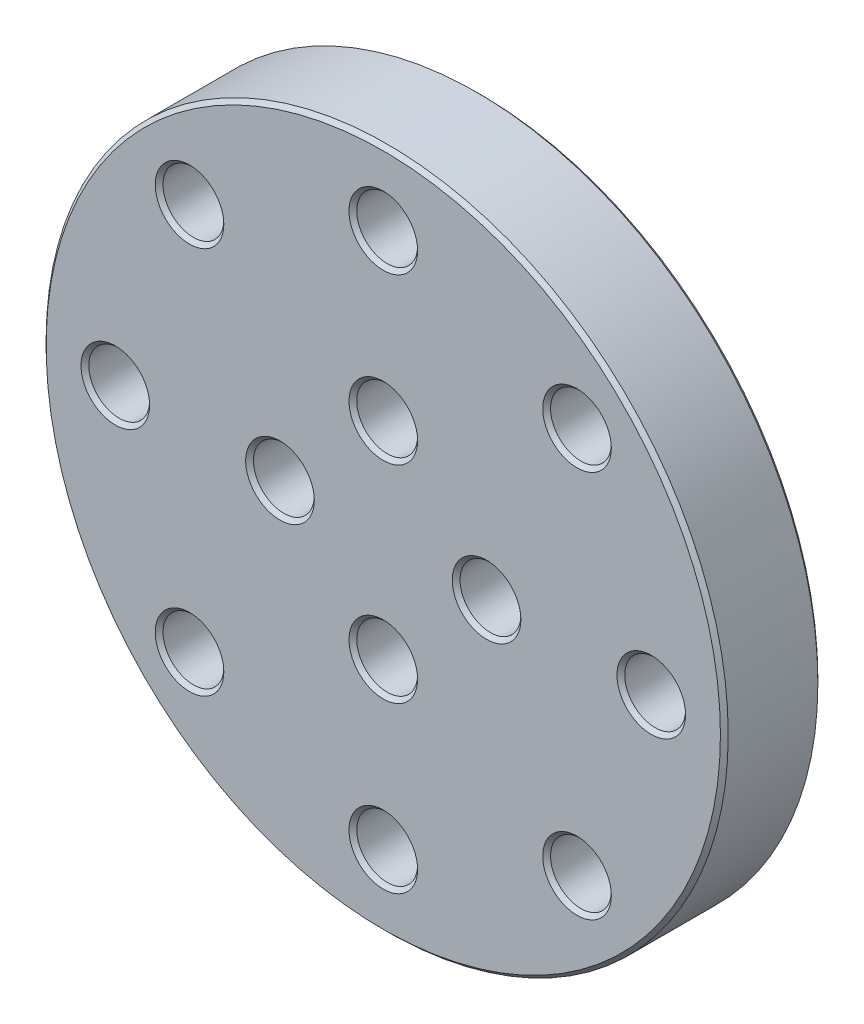
ISO-10303-21;
HEADER;
FILE_DESCRIPTION(('STEP AP214'),'2;1');
FILE_NAME('part.step','',(''),(''),'','','');
FILE_SCHEMA(('AUTOMOTIVE_DESIGN { 1 0 10303 214 1 1 1 1 }'));
ENDSEC;
DATA;
#1=APPLICATION_CONTEXT('core data for automotive mechanical design processes');
#2=APPLICATION_PROTOCOL_DEFINITION('international standard','automotive_design',2000,#1);
#3=PRODUCT_CONTEXT('',#1,'mechanical');
#4=PRODUCT('Part','Part','',(#3));
#5=PRODUCT_RELATED_PRODUCT_CATEGORY('part','',(#4));
#6=PRODUCT_DEFINITION_FORMATION('','',#4);
#7=PRODUCT_DEFINITION_CONTEXT('part definition',#1,'design');
#8=PRODUCT_DEFINITION('design','',#6,#7);
#9=PRODUCT_DEFINITION_SHAPE('','',#8);
#10=(LENGTH_UNIT() NAMED_UNIT(*) SI_UNIT(.MILLI.,.METRE.));
#11=(NAMED_UNIT(*) PLANE_ANGLE_UNIT() SI_UNIT($,.RADIAN.));
#12=(NAMED_UNIT(*) SI_UNIT($,.STERADIAN.) SOLID_ANGLE_UNIT());
#13=UNCERTAINTY_MEASURE_WITH_UNIT(LENGTH_MEASURE(1.E-05),#10,'distance_accuracy_value','');
#14=(GEOMETRIC_REPRESENTATION_CONTEXT(3) GLOBAL_UNCERTAINTY_ASSIGNED_CONTEXT((#13)) GLOBAL_UNIT_ASSIGNED_CONTEXT((#10,
#11,#12)) REPRESENTATION_CONTEXT('',''));
#15=CARTESIAN_POINT('',(0.,0.,0.));
#16=DIRECTION('',(0.,0.,1.));
#17=DIRECTION('',(1.,0.,0.));
#18=AXIS2_PLACEMENT_3D('',#15,#16,#17);
#19=CARTESIAN_POINT('',(0.,0.,12.7));
#20=DIRECTION('',(0.,0.,1.));
#21=DIRECTION('',(1.,0.,0.));
#22=AXIS2_PLACEMENT_3D('',#19,#20,#21);
#23=PLANE('',#22);
#24=CARTESIAN_POINT('',(0.,0.,12.7));
#25=DIRECTION('',(0.,0.,1.));
#26=DIRECTION('',(1.,0.,0.));
#27=AXIS2_PLACEMENT_3D('',#24,#25,#26);
#28=CIRCLE('',#27,43.942);
#29=CARTESIAN_POINT('',(43.942,0.,12.7));
#30=VERTEX_POINT('',#29);
#31=EDGE_CURVE('E47',#30,#30,#28,.T.);
#32=ORIENTED_EDGE('',*,*,#31,.T.);
#33=EDGE_LOOP('',(#32));
#34=FACE_BOUND('',#33,.T.);
#35=CARTESIAN_POINT('',(25.2524802124464,25.2524802124465,12.7));
#36=DIRECTION('',(0.,0.,1.));
#37=DIRECTION('',(1.,0.,0.));
#38=AXIS2_PLACEMENT_3D('',#35,#36,#37);
#39=CIRCLE('',#38,4.47040000000001);
#40=CARTESIAN_POINT('',(29.7228802124464,25.2524802124465,12.7));
#41=VERTEX_POINT('',#40);
#42=EDGE_CURVE('E52',#41,#41,#39,.F.);
#43=ORIENTED_EDGE('',*,*,#42,.T.);
#44=EDGE_LOOP('',(#43));
#45=FACE_BOUND('',#44,.T.);
#46=CARTESIAN_POINT('',(25.2524802124464,-25.2524802124465,12.7));
#47=DIRECTION('',(0.,0.,1.));
#48=DIRECTION('',(1.,0.,0.));
#49=AXIS2_PLACEMENT_3D('',#46,#47,#48);
#50=CIRCLE('',#49,4.47040000000001);
#51=CARTESIAN_POINT('',(29.7228802124464,-25.2524802124465,12.7));
#52=VERTEX_POINT('',#51);
#53=EDGE_CURVE('E55',#52,#52,#50,.F.);
#54=ORIENTED_EDGE('',*,*,#53,.T.);
#55=EDGE_LOOP('',(#54));
#56=FACE_BOUND('',#55,.T.);
#57=CARTESIAN_POINT('',(-25.2524802124466,-25.2524802124463,12.7));
#58=DIRECTION('',(0.,0.,1.));
#59=DIRECTION('',(1.,0.,0.));
#60=AXIS2_PLACEMENT_3D('',#57,#58,#59);
#61=CIRCLE('',#60,4.47040000000001);
#62=CARTESIAN_POINT('',(-20.7820802124466,-25.2524802124463,12.7));
#63=VERTEX_POINT('',#62);
#64=EDGE_CURVE('E58',#63,#63,#61,.F.);
#65=ORIENTED_EDGE('',*,*,#64,.T.);
#66=EDGE_LOOP('',(#65));
#67=FACE_BOUND('',#66,.T.);
#68=CARTESIAN_POINT('',(-25.2524802124466,25.2524802124463,12.7));
#69=DIRECTION('',(0.,0.,1.));
#70=DIRECTION('',(1.,0.,0.));
#71=AXIS2_PLACEMENT_3D('',#68,#69,#70);
#72=CIRCLE('',#71,4.47040000000001);
#73=CARTESIAN_POINT('',(-20.7820802124466,25.2524802124463,12.7));
#74=VERTEX_POINT('',#73);
#75=EDGE_CURVE('E61',#74,#74,#72,.F.);
#76=ORIENTED_EDGE('',*,*,#75,.T.);
#77=EDGE_LOOP('',(#76));
#78=FACE_BOUND('',#77,.T.);
#79=CARTESIAN_POINT('',(13.462,0.,12.7));
#80=DIRECTION('',(0.,0.,1.));
#81=DIRECTION('',(1.,0.,0.));
#82=AXIS2_PLACEMENT_3D('',#79,#80,#81);
#83=CIRCLE('',#82,4.4704);
#84=CARTESIAN_POINT('',(17.9324,0.,12.7));
#85=VERTEX_POINT('',#84);
#86=EDGE_CURVE('E124',#85,#85,#83,.F.);
#87=ORIENTED_EDGE('',*,*,#86,.T.);
#88=EDGE_LOOP('',(#87));
#89=FACE_BOUND('',#88,.T.);
#90=CARTESIAN_POINT('',(0.,-13.462,12.7));
#91=DIRECTION('',(0.,0.,1.));
#92=DIRECTION('',(1.,0.,0.));
#93=AXIS2_PLACEMENT_3D('',#90,#91,#92);
#94=CIRCLE('',#93,4.4704);
#95=CARTESIAN_POINT('',(4.4704,-13.462,12.7));
#96=VERTEX_POINT('',#95);
#97=EDGE_CURVE('E127',#96,#96,#94,.F.);
#98=ORIENTED_EDGE('',*,*,#97,.T.);
#99=EDGE_LOOP('',(#98));
#100=FACE_BOUND('',#99,.T.);
#101=CARTESIAN_POINT('',(-13.462,0.,12.7));
#102=DIRECTION('',(0.,0.,1.));
#103=DIRECTION('',(1.,0.,0.));
#104=AXIS2_PLACEMENT_3D('',#101,#102,#103);
#105=CIRCLE('',#104,4.4704);
#106=CARTESIAN_POINT('',(-8.99159999999999,0.,12.7));
#107=VERTEX_POINT('',#106);
#108=EDGE_CURVE('E130',#107,#107,#105,.F.);
#109=ORIENTED_EDGE('',*,*,#108,.T.);
#110=EDGE_LOOP('',(#109));
#111=FACE_BOUND('',#110,.T.);
#112=CARTESIAN_POINT('',(0.,13.462,12.7));
#113=DIRECTION('',(0.,0.,1.));
#114=DIRECTION('',(1.,0.,0.));
#115=AXIS2_PLACEMENT_3D('',#112,#113,#114);
#116=CIRCLE('',#115,4.4704);
#117=CARTESIAN_POINT('',(4.4704,13.462,12.7));
#118=VERTEX_POINT('',#117);
#119=EDGE_CURVE('E133',#118,#118,#116,.F.);
#120=ORIENTED_EDGE('',*,*,#119,.T.);
#121=EDGE_LOOP('',(#120));
#122=FACE_BOUND('',#121,.T.);
#123=CARTESIAN_POINT('',(-34.925,-3.75722139002858E-13,12.7));
#124=DIRECTION('',(0.,0.,1.));
#125=DIRECTION('',(1.,0.,0.));
#126=AXIS2_PLACEMENT_3D('',#123,#124,#125);
#127=CIRCLE('',#126,4.4704);
#128=CARTESIAN_POINT('',(-30.4546,-3.75722139002858E-13,12.7));
#129=VERTEX_POINT('',#128);
#130=EDGE_CURVE('E136',#129,#129,#127,.F.);
#131=ORIENTED_EDGE('',*,*,#130,.T.);
#132=EDGE_LOOP('',(#131));
#133=FACE_BOUND('',#132,.T.);
#134=CARTESIAN_POINT('',(-2.53782153243762E-13,34.925,12.7));
#135=DIRECTION('',(0.,0.,1.));
#136=DIRECTION('',(1.,0.,0.));
#137=AXIS2_PLACEMENT_3D('',#134,#135,#136);
#138=CIRCLE('',#137,4.4704);
#139=CARTESIAN_POINT('',(4.47039999999975,34.925,12.7));
#140=VERTEX_POINT('',#139);
#141=EDGE_CURVE('E139',#140,#140,#138,.F.);
#142=ORIENTED_EDGE('',*,*,#141,.T.);
#143=EDGE_LOOP('',(#142));
#144=FACE_BOUND('',#143,.T.);
#145=CARTESIAN_POINT('',(34.925,1.31842167484666E-13,12.7));
#146=DIRECTION('',(0.,0.,1.));
#147=DIRECTION('',(1.,0.,0.));
#148=AXIS2_PLACEMENT_3D('',#145,#146,#147);
#149=CIRCLE('',#148,4.4704);
#150=CARTESIAN_POINT('',(39.3954,1.31842167484666E-13,12.7));
#151=VERTEX_POINT('',#150);
#152=EDGE_CURVE('E142',#151,#151,#149,.F.);
#153=ORIENTED_EDGE('',*,*,#152,.T.);
#154=EDGE_LOOP('',(#153));
#155=FACE_BOUND('',#154,.T.);
#156=CARTESIAN_POINT('',(0.,-34.925,12.7));
#157=DIRECTION('',(0.,0.,1.));
#158=DIRECTION('',(1.,0.,0.));
#159=AXIS2_PLACEMENT_3D('',#156,#157,#158);
#160=CIRCLE('',#159,4.4704);
#161=CARTESIAN_POINT('',(4.47040000000001,-34.925,12.7));
#162=VERTEX_POINT('',#161);
#163=EDGE_CURVE('E145',#162,#162,#160,.F.);
#164=ORIENTED_EDGE('',*,*,#163,.T.);
#165=EDGE_LOOP('',(#164));
#166=FACE_BOUND('',#165,.T.);
#167=ADVANCED_FACE('F32',(#34,#45,#56,#67,#78,#89,#100,#111,#122,#133,#144,#155,#166),#23,.T.);
#168=CARTESIAN_POINT('',(0.,0.,0.));
#169=DIRECTION('',(0.,0.,1.));
#170=DIRECTION('',(1.,0.,0.));
#171=AXIS2_PLACEMENT_3D('',#168,#169,#170);
#172=PLANE('',#171);
#173=CARTESIAN_POINT('',(0.,0.,0.));
#174=DIRECTION('',(0.,0.,1.));
#175=DIRECTION('',(1.,0.,0.));
#176=AXIS2_PLACEMENT_3D('',#173,#174,#175);
#177=CIRCLE('',#176,43.942);
#178=CARTESIAN_POINT('',(43.942,0.,0.));
#179=VERTEX_POINT('',#178);
#180=EDGE_CURVE('E10',#179,#179,#177,.F.);
#181=ORIENTED_EDGE('',*,*,#180,.T.);
#182=EDGE_LOOP('',(#181));
#183=FACE_BOUND('',#182,.T.);
#184=CARTESIAN_POINT('',(25.2524802124464,25.2524802124465,0.));
#185=DIRECTION('',(0.,0.,1.));
#186=DIRECTION('',(1.,0.,0.));
#187=AXIS2_PLACEMENT_3D('',#184,#185,#186);
#188=CIRCLE('',#187,4.4704);
#189=CARTESIAN_POINT('',(29.7228802124464,25.2524802124465,0.));
#190=VERTEX_POINT('',#189);
#191=EDGE_CURVE('E97',#190,#190,#188,.T.);
#192=ORIENTED_EDGE('',*,*,#191,.T.);
#193=EDGE_LOOP('',(#192));
#194=FACE_BOUND('',#193,.T.);
#195=CARTESIAN_POINT('',(-25.2524802124466,-25.2524802124463,0.));
#196=DIRECTION('',(0.,0.,1.));
#197=DIRECTION('',(1.,0.,0.));
#198=AXIS2_PLACEMENT_3D('',#195,#196,#197);
#199=CIRCLE('',#198,4.4704);
#200=CARTESIAN_POINT('',(-20.7820802124466,-25.2524802124463,0.));
#201=VERTEX_POINT('',#200);
#202=EDGE_CURVE('E100',#201,#201,#199,.T.);
#203=ORIENTED_EDGE('',*,*,#202,.T.);
#204=EDGE_LOOP('',(#203));
#205=FACE_BOUND('',#204,.T.);
#206=CARTESIAN_POINT('',(25.2524802124464,-25.2524802124465,0.));
#207=DIRECTION('',(0.,0.,1.));
#208=DIRECTION('',(1.,0.,0.));
#209=AXIS2_PLACEMENT_3D('',#206,#207,#208);
#210=CIRCLE('',#209,4.4704);
#211=CARTESIAN_POINT('',(29.7228802124464,-25.2524802124465,0.));
#212=VERTEX_POINT('',#211);
#213=EDGE_CURVE('E103',#212,#212,#210,.T.);
#214=ORIENTED_EDGE('',*,*,#213,.T.);
#215=EDGE_LOOP('',(#214));
#216=FACE_BOUND('',#215,.T.);
#217=CARTESIAN_POINT('',(13.462,0.,0.));
#218=DIRECTION('',(0.,0.,1.));
#219=DIRECTION('',(1.,0.,0.));
#220=AXIS2_PLACEMENT_3D('',#217,#218,#219);
#221=CIRCLE('',#220,4.4704);
#222=CARTESIAN_POINT('',(17.9324,0.,0.));
#223=VERTEX_POINT('',#222);
#224=EDGE_CURVE('E106',#223,#223,#221,.T.);
#225=ORIENTED_EDGE('',*,*,#224,.T.);
#226=EDGE_LOOP('',(#225));
#227=FACE_BOUND('',#226,.T.);
#228=CARTESIAN_POINT('',(0.,-13.462,0.));
#229=DIRECTION('',(0.,0.,1.));
#230=DIRECTION('',(1.,0.,0.));
#231=AXIS2_PLACEMENT_3D('',#228,#229,#230);
#232=CIRCLE('',#231,4.4704);
#233=CARTESIAN_POINT('',(4.4704,-13.462,0.));
#234=VERTEX_POINT('',#233);
#235=EDGE_CURVE('E109',#234,#234,#232,.T.);
#236=ORIENTED_EDGE('',*,*,#235,.T.);
#237=EDGE_LOOP('',(#236));
#238=FACE_BOUND('',#237,.T.);
#239=CARTESIAN_POINT('',(-13.462,0.,0.));
#240=DIRECTION('',(0.,0.,1.));
#241=DIRECTION('',(1.,0.,0.));
#242=AXIS2_PLACEMENT_3D('',#239,#240,#241);
#243=CIRCLE('',#242,4.4704);
#244=CARTESIAN_POINT('',(-8.9916,0.,0.));
#245=VERTEX_POINT('',#244);
#246=EDGE_CURVE('E112',#245,#245,#243,.T.);
#247=ORIENTED_EDGE('',*,*,#246,.T.);
#248=EDGE_LOOP('',(#247));
#249=FACE_BOUND('',#248,.T.);
#250=CARTESIAN_POINT('',(-25.2524802124466,25.2524802124463,0.));
#251=DIRECTION('',(0.,0.,1.));
#252=DIRECTION('',(1.,0.,0.));
#253=AXIS2_PLACEMENT_3D('',#250,#251,#252);
#254=CIRCLE('',#253,4.4704);
#255=CARTESIAN_POINT('',(-20.7820802124466,25.2524802124463,0.));
#256=VERTEX_POINT('',#255);
#257=EDGE_CURVE('E115',#256,#256,#254,.T.);
#258=ORIENTED_EDGE('',*,*,#257,.T.);
#259=EDGE_LOOP('',(#258));
#260=FACE_BOUND('',#259,.T.);
#261=CARTESIAN_POINT('',(0.,13.462,0.));
#262=DIRECTION('',(0.,0.,1.));
#263=DIRECTION('',(1.,0.,0.));
#264=AXIS2_PLACEMENT_3D('',#261,#262,#263);
#265=CIRCLE('',#264,4.4704);
#266=CARTESIAN_POINT('',(4.4704,13.462,0.));
#267=VERTEX_POINT('',#266);
#268=EDGE_CURVE('E181',#267,#267,#265,.T.);
#269=ORIENTED_EDGE('',*,*,#268,.T.);
#270=EDGE_LOOP('',(#269));
#271=FACE_BOUND('',#270,.T.);
#272=CARTESIAN_POINT('',(-2.53782153243762E-13,34.925,0.));
#273=DIRECTION('',(0.,0.,1.));
#274=DIRECTION('',(1.,0.,0.));
#275=AXIS2_PLACEMENT_3D('',#272,#273,#274);
#276=CIRCLE('',#275,4.4704);
#277=CARTESIAN_POINT('',(4.47039999999975,34.925,0.));
#278=VERTEX_POINT('',#277);
#279=EDGE_CURVE('E184',#278,#278,#276,.T.);
#280=ORIENTED_EDGE('',*,*,#279,.T.);
#281=EDGE_LOOP('',(#280));
#282=FACE_BOUND('',#281,.T.);
#283=CARTESIAN_POINT('',(34.925,1.31842167484666E-13,0.));
#284=DIRECTION('',(0.,0.,1.));
#285=DIRECTION('',(1.,0.,0.));
#286=AXIS2_PLACEMENT_3D('',#283,#284,#285);
#287=CIRCLE('',#286,4.4704);
#288=CARTESIAN_POINT('',(39.3954,1.31842167484666E-13,0.));
#289=VERTEX_POINT('',#288);
#290=EDGE_CURVE('E187',#289,#289,#287,.T.);
#291=ORIENTED_EDGE('',*,*,#290,.T.);
#292=EDGE_LOOP('',(#291));
#293=FACE_BOUND('',#292,.T.);
#294=CARTESIAN_POINT('',(0.,-34.925,0.));
#295=DIRECTION('',(0.,0.,1.));
#296=DIRECTION('',(1.,0.,0.));
#297=AXIS2_PLACEMENT_3D('',#294,#295,#296);
#298=CIRCLE('',#297,4.4704);
#299=CARTESIAN_POINT('',(4.47040000000001,-34.925,0.));
#300=VERTEX_POINT('',#299);
#301=EDGE_CURVE('E190',#300,#300,#298,.T.);
#302=ORIENTED_EDGE('',*,*,#301,.T.);
#303=EDGE_LOOP('',(#302));
#304=FACE_BOUND('',#303,.T.);
#305=CARTESIAN_POINT('',(-34.925,-3.75722139002858E-13,0.));
#306=DIRECTION('',(0.,0.,1.));
#307=DIRECTION('',(1.,0.,0.));
#308=AXIS2_PLACEMENT_3D('',#305,#306,#307);
#309=CIRCLE('',#308,4.4704);
#310=CARTESIAN_POINT('',(-30.4546,-3.75722139002858E-13,0.));
#311=VERTEX_POINT('',#310);
#312=EDGE_CURVE('E193',#311,#311,#309,.T.);
#313=ORIENTED_EDGE('',*,*,#312,.T.);
#314=EDGE_LOOP('',(#313));
#315=FACE_BOUND('',#314,.T.);
#316=ADVANCED_FACE('F197',(#183,#194,#205,#216,#227,#238,#249,#260,#271,#282,#293,#304,#315),
#172,.F.);
#317=CARTESIAN_POINT('',(0.,0.,12.7));
#318=DIRECTION('',(0.,0.,-1.));
#319=DIRECTION('',(-1.,0.,0.));
#320=AXIS2_PLACEMENT_3D('',#317,#318,#319);
#321=CYLINDRICAL_SURFACE('',#320,44.45);
#322=CARTESIAN_POINT('',(0.,0.,12.192));
#323=DIRECTION('',(0.,0.,1.));
#324=DIRECTION('',(1.,0.,0.));
#325=AXIS2_PLACEMENT_3D('',#322,#323,#324);
#326=CIRCLE('',#325,44.45);
#327=CARTESIAN_POINT('',(44.45,0.,12.192));
#328=VERTEX_POINT('',#327);
#329=EDGE_CURVE('E39',#328,#328,#326,.F.);
#330=ORIENTED_EDGE('',*,*,#329,.T.);
#331=EDGE_LOOP('',(#330));
#332=FACE_BOUND('',#331,.T.);
#333=CARTESIAN_POINT('',(0.,0.,0.508000000000002));
#334=DIRECTION('',(0.,0.,1.));
#335=DIRECTION('',(1.,0.,0.));
#336=AXIS2_PLACEMENT_3D('',#333,#334,#335);
#337=CIRCLE('',#336,44.45);
#338=CARTESIAN_POINT('',(44.45,0.,0.508000000000002));
#339=VERTEX_POINT('',#338);
#340=EDGE_CURVE('E43',#339,#339,#337,.T.);
#341=ORIENTED_EDGE('',*,*,#340,.T.);
#342=EDGE_LOOP('',(#341));
#343=FACE_BOUND('',#342,.T.);
#344=ADVANCED_FACE('F222',(#332,#343),#321,.T.);
#345=CARTESIAN_POINT('',(-13.462,0.,12.7));
#346=DIRECTION('',(0.,0.,-1.));
#347=DIRECTION('',(-1.,0.,0.));
#348=AXIS2_PLACEMENT_3D('',#345,#346,#347);
#349=CYLINDRICAL_SURFACE('',#348,3.9624);
#350=CARTESIAN_POINT('',(-13.462,0.,0.508000000000003));
#351=DIRECTION('',(0.,0.,1.));
#352=DIRECTION('',(1.,0.,0.));
#353=AXIS2_PLACEMENT_3D('',#350,#351,#352);
#354=CIRCLE('',#353,3.9624);
#355=CARTESIAN_POINT('',(-9.4996,0.,0.508000000000003));
#356=VERTEX_POINT('',#355);
#357=EDGE_CURVE('E70',#356,#356,#354,.F.);
#358=ORIENTED_EDGE('',*,*,#357,.T.);
#359=EDGE_LOOP('',(#358));
#360=FACE_BOUND('',#359,.T.);
#361=CARTESIAN_POINT('',(-13.462,0.,12.192));
#362=DIRECTION('',(0.,0.,1.));
#363=DIRECTION('',(1.,0.,0.));
#364=AXIS2_PLACEMENT_3D('',#361,#362,#363);
#365=CIRCLE('',#364,3.9624);
#366=CARTESIAN_POINT('',(-9.4996,0.,12.192));
#367=VERTEX_POINT('',#366);
#368=EDGE_CURVE('E118',#367,#367,#365,.T.);
#369=ORIENTED_EDGE('',*,*,#368,.T.);
#370=EDGE_LOOP('',(#369));
#371=FACE_BOUND('',#370,.T.);
#372=ADVANCED_FACE('F226',(#360,#371),#349,.F.);
#373=CARTESIAN_POINT('',(0.,13.462,12.7));
#374=DIRECTION('',(0.,0.,-1.));
#375=DIRECTION('',(-1.,0.,0.));
#376=AXIS2_PLACEMENT_3D('',#373,#374,#375);
#377=CYLINDRICAL_SURFACE('',#376,3.9624);
#378=CARTESIAN_POINT('',(0.,13.462,0.508));
#379=DIRECTION('',(0.,0.,1.));
#380=DIRECTION('',(1.,0.,0.));
#381=AXIS2_PLACEMENT_3D('',#378,#379,#380);
#382=CIRCLE('',#381,3.9624);
#383=CARTESIAN_POINT('',(3.9624,13.462,0.508));
#384=VERTEX_POINT('',#383);
#385=EDGE_CURVE('E175',#384,#384,#382,.F.);
#386=ORIENTED_EDGE('',*,*,#385,.T.);
#387=EDGE_LOOP('',(#386));
#388=FACE_BOUND('',#387,.T.);
#389=CARTESIAN_POINT('',(0.,13.462,12.192));
#390=DIRECTION('',(0.,0.,1.));
#391=DIRECTION('',(1.,0.,0.));
#392=AXIS2_PLACEMENT_3D('',#389,#390,#391);
#393=CIRCLE('',#392,3.9624);
#394=CARTESIAN_POINT('',(3.9624,13.462,12.192));
#395=VERTEX_POINT('',#394);
#396=EDGE_CURVE('E178',#395,#395,#393,.T.);
#397=ORIENTED_EDGE('',*,*,#396,.T.);
#398=EDGE_LOOP('',(#397));
#399=FACE_BOUND('',#398,.T.);
#400=ADVANCED_FACE('F489',(#388,#399),#377,.F.);
#401=CARTESIAN_POINT('',(13.462,0.,12.7));
#402=DIRECTION('',(0.,0.,-1.));
#403=DIRECTION('',(-1.,0.,0.));
#404=AXIS2_PLACEMENT_3D('',#401,#402,#403);
#405=CYLINDRICAL_SURFACE('',#404,3.9624);
#406=CARTESIAN_POINT('',(13.462,0.,0.508000000000002));
#407=DIRECTION('',(0.,0.,1.));
#408=DIRECTION('',(1.,0.,0.));
#409=AXIS2_PLACEMENT_3D('',#406,#407,#408);
#410=CIRCLE('',#409,3.9624);
#411=CARTESIAN_POINT('',(17.4244,0.,0.508000000000002));
#412=VERTEX_POINT('',#411);
#413=EDGE_CURVE('E76',#412,#412,#410,.F.);
#414=ORIENTED_EDGE('',*,*,#413,.T.);
#415=EDGE_LOOP('',(#414));
#416=FACE_BOUND('',#415,.T.);
#417=CARTESIAN_POINT('',(13.462,0.,12.192));
#418=DIRECTION('',(0.,0.,1.));
#419=DIRECTION('',(1.,0.,0.));
#420=AXIS2_PLACEMENT_3D('',#417,#418,#419);
#421=CIRCLE('',#420,3.9624);
#422=CARTESIAN_POINT('',(17.4244,0.,12.192));
#423=VERTEX_POINT('',#422);
#424=EDGE_CURVE('E148',#423,#423,#421,.T.);
#425=ORIENTED_EDGE('',*,*,#424,.T.);
#426=EDGE_LOOP('',(#425));
#427=FACE_BOUND('',#426,.T.);
#428=ADVANCED_FACE('F478',(#416,#427),#405,.F.);
#429=CARTESIAN_POINT('',(0.,-13.462,12.7));
#430=DIRECTION('',(0.,0.,-1.));
#431=DIRECTION('',(-1.,0.,0.));
#432=AXIS2_PLACEMENT_3D('',#429,#430,#431);
#433=CYLINDRICAL_SURFACE('',#432,3.9624);
#434=CARTESIAN_POINT('',(0.,-13.462,0.508));
#435=DIRECTION('',(0.,0.,1.));
#436=DIRECTION('',(1.,0.,0.));
#437=AXIS2_PLACEMENT_3D('',#434,#435,#436);
#438=CIRCLE('',#437,3.9624);
#439=CARTESIAN_POINT('',(3.9624,-13.462,0.508));
#440=VERTEX_POINT('',#439);
#441=EDGE_CURVE('E73',#440,#440,#438,.F.);
#442=ORIENTED_EDGE('',*,*,#441,.T.);
#443=EDGE_LOOP('',(#442));
#444=FACE_BOUND('',#443,.T.);
#445=CARTESIAN_POINT('',(0.,-13.462,12.192));
#446=DIRECTION('',(0.,0.,1.));
#447=DIRECTION('',(1.,0.,0.));
#448=AXIS2_PLACEMENT_3D('',#445,#446,#447);
#449=CIRCLE('',#448,3.9624);
#450=CARTESIAN_POINT('',(3.9624,-13.462,12.192));
#451=VERTEX_POINT('',#450);
#452=EDGE_CURVE('E121',#451,#451,#449,.T.);
#453=ORIENTED_EDGE('',*,*,#452,.T.);
#454=EDGE_LOOP('',(#453));
#455=FACE_BOUND('',#454,.T.);
#456=ADVANCED_FACE('F473',(#444,#455),#433,.F.);
#457=CARTESIAN_POINT('',(0.,-34.925,12.7));
#458=DIRECTION('',(0.,0.,-1.));
#459=DIRECTION('',(-1.,0.,0.));
#460=AXIS2_PLACEMENT_3D('',#457,#458,#459);
#461=CYLINDRICAL_SURFACE('',#460,3.9624);
#462=CARTESIAN_POINT('',(0.,-34.925,0.508000000000002));
#463=DIRECTION('',(0.,0.,1.));
#464=DIRECTION('',(1.,0.,0.));
#465=AXIS2_PLACEMENT_3D('',#462,#463,#464);
#466=CIRCLE('',#465,3.9624);
#467=CARTESIAN_POINT('',(3.96240000000001,-34.925,0.508000000000002));
#468=VERTEX_POINT('',#467);
#469=EDGE_CURVE('E157',#468,#468,#466,.F.);
#470=ORIENTED_EDGE('',*,*,#469,.T.);
#471=EDGE_LOOP('',(#470));
#472=FACE_BOUND('',#471,.T.);
#473=CARTESIAN_POINT('',(0.,-34.925,12.192));
#474=DIRECTION('',(0.,0.,1.));
#475=DIRECTION('',(1.,0.,0.));
#476=AXIS2_PLACEMENT_3D('',#473,#474,#475);
#477=CIRCLE('',#476,3.9624);
#478=CARTESIAN_POINT('',(3.96240000000001,-34.925,12.192));
#479=VERTEX_POINT('',#478);
#480=EDGE_CURVE('E160',#479,#479,#477,.T.);
#481=ORIENTED_EDGE('',*,*,#480,.T.);
#482=EDGE_LOOP('',(#481));
#483=FACE_BOUND('',#482,.T.);
#484=ADVANCED_FACE('F256',(#472,#483),#461,.F.);
#485=CARTESIAN_POINT('',(34.925,1.31842167484666E-13,12.7));
#486=DIRECTION('',(0.,0.,-1.));
#487=DIRECTION('',(-1.,0.,0.));
#488=AXIS2_PLACEMENT_3D('',#485,#486,#487);
#489=CYLINDRICAL_SURFACE('',#488,3.9624);
#490=CARTESIAN_POINT('',(34.925,1.31842167484666E-13,0.508000000000002));
#491=DIRECTION('',(0.,0.,1.));
#492=DIRECTION('',(1.,0.,0.));
#493=AXIS2_PLACEMENT_3D('',#490,#491,#492);
#494=CIRCLE('',#493,3.9624);
#495=CARTESIAN_POINT('',(38.8874,1.31842167484666E-13,0.508000000000002));
#496=VERTEX_POINT('',#495);
#497=EDGE_CURVE('E163',#496,#496,#494,.F.);
#498=ORIENTED_EDGE('',*,*,#497,.T.);
#499=EDGE_LOOP('',(#498));
#500=FACE_BOUND('',#499,.T.);
#501=CARTESIAN_POINT('',(34.925,1.31842167484666E-13,12.192));
#502=DIRECTION('',(0.,0.,1.));
#503=DIRECTION('',(1.,0.,0.));
#504=AXIS2_PLACEMENT_3D('',#501,#502,#503);
#505=CIRCLE('',#504,3.9624);
#506=CARTESIAN_POINT('',(38.8874,1.31842167484666E-13,12.192));
#507=VERTEX_POINT('',#506);
#508=EDGE_CURVE('E166',#507,#507,#505,.T.);
#509=ORIENTED_EDGE('',*,*,#508,.T.);
#510=EDGE_LOOP('',(#509));
#511=FACE_BOUND('',#510,.T.);
#512=ADVANCED_FACE('F252',(#500,#511),#489,.F.);
#513=CARTESIAN_POINT('',(-2.53782153243762E-13,34.925,12.7));
#514=DIRECTION('',(0.,0.,-1.));
#515=DIRECTION('',(-1.,0.,0.));
#516=AXIS2_PLACEMENT_3D('',#513,#514,#515);
#517=CYLINDRICAL_SURFACE('',#516,3.9624);
#518=CARTESIAN_POINT('',(-2.53782153243762E-13,34.925,0.508000000000002));
#519=DIRECTION('',(0.,0.,1.));
#520=DIRECTION('',(1.,0.,0.));
#521=AXIS2_PLACEMENT_3D('',#518,#519,#520);
#522=CIRCLE('',#521,3.9624);
#523=CARTESIAN_POINT('',(3.96239999999975,34.925,0.508000000000002));
#524=VERTEX_POINT('',#523);
#525=EDGE_CURVE('E169',#524,#524,#522,.F.);
#526=ORIENTED_EDGE('',*,*,#525,.T.);
#527=EDGE_LOOP('',(#526));
#528=FACE_BOUND('',#527,.T.);
#529=CARTESIAN_POINT('',(-2.53782153243762E-13,34.925,12.192));
#530=DIRECTION('',(0.,0.,1.));
#531=DIRECTION('',(1.,0.,0.));
#532=AXIS2_PLACEMENT_3D('',#529,#530,#531);
#533=CIRCLE('',#532,3.9624);
#534=CARTESIAN_POINT('',(3.96239999999975,34.925,12.192));
#535=VERTEX_POINT('',#534);
#536=EDGE_CURVE('E172',#535,#535,#533,.T.);
#537=ORIENTED_EDGE('',*,*,#536,.T.);
#538=EDGE_LOOP('',(#537));
#539=FACE_BOUND('',#538,.T.);
#540=ADVANCED_FACE('F255',(#528,#539),#517,.F.);
#541=CARTESIAN_POINT('',(-34.925,-3.75722139002858E-13,12.7));
#542=DIRECTION('',(0.,0.,-1.));
#543=DIRECTION('',(-1.,0.,0.));
#544=AXIS2_PLACEMENT_3D('',#541,#542,#543);
#545=CYLINDRICAL_SURFACE('',#544,3.9624);
#546=CARTESIAN_POINT('',(-34.925,-3.75722139002858E-13,0.508000000000002));
#547=DIRECTION('',(0.,0.,1.));
#548=DIRECTION('',(1.,0.,0.));
#549=AXIS2_PLACEMENT_3D('',#546,#547,#548);
#550=CIRCLE('',#549,3.9624);
#551=CARTESIAN_POINT('',(-30.9626,-3.75722139002858E-13,0.508000000000002));
#552=VERTEX_POINT('',#551);
#553=EDGE_CURVE('E151',#552,#552,#550,.F.);
#554=ORIENTED_EDGE('',*,*,#553,.T.);
#555=EDGE_LOOP('',(#554));
#556=FACE_BOUND('',#555,.T.);
#557=CARTESIAN_POINT('',(-34.925,-3.75722139002858E-13,12.192));
#558=DIRECTION('',(0.,0.,1.));
#559=DIRECTION('',(1.,0.,0.));
#560=AXIS2_PLACEMENT_3D('',#557,#558,#559);
#561=CIRCLE('',#560,3.9624);
#562=CARTESIAN_POINT('',(-30.9626,-3.75722139002858E-13,12.192));
#563=VERTEX_POINT('',#562);
#564=EDGE_CURVE('E154',#563,#563,#561,.T.);
#565=ORIENTED_EDGE('',*,*,#564,.T.);
#566=EDGE_LOOP('',(#565));
#567=FACE_BOUND('',#566,.T.);
#568=ADVANCED_FACE('F235',(#556,#567),#545,.F.);
#569=CARTESIAN_POINT('',(0.,13.462,0.));
#570=DIRECTION('',(0.,0.,-1.));
#571=DIRECTION('',(-1.,0.,0.));
#572=AXIS2_PLACEMENT_3D('',#569,#570,#571);
#573=CONICAL_SURFACE('',#572,4.4704,0.785398163397447);
#574=ORIENTED_EDGE('',*,*,#385,.F.);
#575=EDGE_LOOP('',(#574));
#576=FACE_BOUND('',#575,.T.);
#577=ORIENTED_EDGE('',*,*,#268,.F.);
#578=EDGE_LOOP('',(#577));
#579=FACE_BOUND('',#578,.T.);
#580=ADVANCED_FACE('F231',(#576,#579),#573,.F.);
#581=CARTESIAN_POINT('',(-2.53782153243762E-13,34.925,0.));
#582=DIRECTION('',(0.,0.,-1.));
#583=DIRECTION('',(-1.,0.,0.));
#584=AXIS2_PLACEMENT_3D('',#581,#582,#583);
#585=CONICAL_SURFACE('',#584,4.4704,0.785398163397446);
#586=ORIENTED_EDGE('',*,*,#525,.F.);
#587=EDGE_LOOP('',(#586));
#588=FACE_BOUND('',#587,.T.);
#589=ORIENTED_EDGE('',*,*,#279,.F.);
#590=EDGE_LOOP('',(#589));
#591=FACE_BOUND('',#590,.T.);
#592=ADVANCED_FACE('F234',(#588,#591),#585,.F.);
#593=CARTESIAN_POINT('',(34.925,1.31842167484666E-13,0.));
#594=DIRECTION('',(0.,0.,-1.));
#595=DIRECTION('',(-1.,0.,0.));
#596=AXIS2_PLACEMENT_3D('',#593,#594,#595);
#597=CONICAL_SURFACE('',#596,4.4704,0.785398163397446);
#598=ORIENTED_EDGE('',*,*,#497,.F.);
#599=EDGE_LOOP('',(#598));
#600=FACE_BOUND('',#599,.T.);
#601=ORIENTED_EDGE('',*,*,#290,.F.);
#602=EDGE_LOOP('',(#601));
#603=FACE_BOUND('',#602,.T.);
#604=ADVANCED_FACE('F212',(#600,#603),#597,.F.);
#605=CARTESIAN_POINT('',(0.,-34.925,0.));
#606=DIRECTION('',(0.,0.,-1.));
#607=DIRECTION('',(-1.,0.,0.));
#608=AXIS2_PLACEMENT_3D('',#605,#606,#607);
#609=CONICAL_SURFACE('',#608,4.4704,0.785398163397446);
#610=ORIENTED_EDGE('',*,*,#469,.F.);
#611=EDGE_LOOP('',(#610));
#612=FACE_BOUND('',#611,.T.);
#613=ORIENTED_EDGE('',*,*,#301,.F.);
#614=EDGE_LOOP('',(#613));
#615=FACE_BOUND('',#614,.T.);
#616=ADVANCED_FACE('F202',(#612,#615),#609,.F.);
#617=CARTESIAN_POINT('',(-34.925,-3.75722139002858E-13,0.));
#618=DIRECTION('',(0.,0.,-1.));
#619=DIRECTION('',(-1.,0.,0.));
#620=AXIS2_PLACEMENT_3D('',#617,#618,#619);
#621=CONICAL_SURFACE('',#620,4.4704,0.785398163397446);
#622=ORIENTED_EDGE('',*,*,#553,.F.);
#623=EDGE_LOOP('',(#622));
#624=FACE_BOUND('',#623,.T.);
#625=ORIENTED_EDGE('',*,*,#312,.F.);
#626=EDGE_LOOP('',(#625));
#627=FACE_BOUND('',#626,.T.);
#628=ADVANCED_FACE('F199',(#624,#627),#621,.F.);
#629=CARTESIAN_POINT('',(13.462,0.,12.192));
#630=DIRECTION('',(0.,0.,1.));
#631=DIRECTION('',(1.,0.,0.));
#632=AXIS2_PLACEMENT_3D('',#629,#630,#631);
#633=CONICAL_SURFACE('',#632,3.9624,0.785398163397449);
#634=ORIENTED_EDGE('',*,*,#86,.F.);
#635=EDGE_LOOP('',(#634));
#636=FACE_BOUND('',#635,.T.);
#637=ORIENTED_EDGE('',*,*,#424,.F.);
#638=EDGE_LOOP('',(#637));
#639=FACE_BOUND('',#638,.T.);
#640=ADVANCED_FACE('F201',(#636,#639),#633,.F.);
#641=CARTESIAN_POINT('',(0.,-13.462,12.192));
#642=DIRECTION('',(0.,0.,1.));
#643=DIRECTION('',(1.,0.,0.));
#644=AXIS2_PLACEMENT_3D('',#641,#642,#643);
#645=CONICAL_SURFACE('',#644,3.9624,0.78539816339745);
#646=ORIENTED_EDGE('',*,*,#97,.F.);
#647=EDGE_LOOP('',(#646));
#648=FACE_BOUND('',#647,.T.);
#649=ORIENTED_EDGE('',*,*,#452,.F.);
#650=EDGE_LOOP('',(#649));
#651=FACE_BOUND('',#650,.T.);
#652=ADVANCED_FACE('F209',(#648,#651),#645,.F.);
#653=CARTESIAN_POINT('',(-13.462,0.,12.192));
#654=DIRECTION('',(0.,0.,1.));
#655=DIRECTION('',(1.,0.,0.));
#656=AXIS2_PLACEMENT_3D('',#653,#654,#655);
#657=CONICAL_SURFACE('',#656,3.9624,0.78539816339745);
#658=ORIENTED_EDGE('',*,*,#108,.F.);
#659=EDGE_LOOP('',(#658));
#660=FACE_BOUND('',#659,.T.);
#661=ORIENTED_EDGE('',*,*,#368,.F.);
#662=EDGE_LOOP('',(#661));
#663=FACE_BOUND('',#662,.T.);
#664=ADVANCED_FACE('F531',(#660,#663),#657,.F.);
#665=CARTESIAN_POINT('',(0.,13.462,12.192));
#666=DIRECTION('',(0.,0.,1.));
#667=DIRECTION('',(1.,0.,0.));
#668=AXIS2_PLACEMENT_3D('',#665,#666,#667);
#669=CONICAL_SURFACE('',#668,3.9624,0.78539816339745);
#670=ORIENTED_EDGE('',*,*,#119,.F.);
#671=EDGE_LOOP('',(#670));
#672=FACE_BOUND('',#671,.T.);
#673=ORIENTED_EDGE('',*,*,#396,.F.);
#674=EDGE_LOOP('',(#673));
#675=FACE_BOUND('',#674,.T.);
#676=ADVANCED_FACE('F522',(#672,#675),#669,.F.);
#677=CARTESIAN_POINT('',(-34.925,-3.75722139002858E-13,12.192));
#678=DIRECTION('',(0.,0.,1.));
#679=DIRECTION('',(1.,0.,0.));
#680=AXIS2_PLACEMENT_3D('',#677,#678,#679);
#681=CONICAL_SURFACE('',#680,3.9624,0.785398163397448);
#682=ORIENTED_EDGE('',*,*,#130,.F.);
#683=EDGE_LOOP('',(#682));
#684=FACE_BOUND('',#683,.T.);
#685=ORIENTED_EDGE('',*,*,#564,.F.);
#686=EDGE_LOOP('',(#685));
#687=FACE_BOUND('',#686,.T.);
#688=ADVANCED_FACE('F273',(#684,#687),#681,.F.);
#689=CARTESIAN_POINT('',(-2.53782153243762E-13,34.925,12.192));
#690=DIRECTION('',(0.,0.,1.));
#691=DIRECTION('',(1.,0.,0.));
#692=AXIS2_PLACEMENT_3D('',#689,#690,#691);
#693=CONICAL_SURFACE('',#692,3.9624,0.785398163397448);
#694=ORIENTED_EDGE('',*,*,#141,.F.);
#695=EDGE_LOOP('',(#694));
#696=FACE_BOUND('',#695,.T.);
#697=ORIENTED_EDGE('',*,*,#536,.F.);
#698=EDGE_LOOP('',(#697));
#699=FACE_BOUND('',#698,.T.);
#700=ADVANCED_FACE('F263',(#696,#699),#693,.F.);
#701=CARTESIAN_POINT('',(34.925,1.31842167484666E-13,12.192));
#702=DIRECTION('',(0.,0.,1.));
#703=DIRECTION('',(1.,0.,0.));
#704=AXIS2_PLACEMENT_3D('',#701,#702,#703);
#705=CONICAL_SURFACE('',#704,3.9624,0.785398163397448);
#706=ORIENTED_EDGE('',*,*,#152,.F.);
#707=EDGE_LOOP('',(#706));
#708=FACE_BOUND('',#707,.T.);
#709=ORIENTED_EDGE('',*,*,#508,.F.);
#710=EDGE_LOOP('',(#709));
#711=FACE_BOUND('',#710,.T.);
#712=ADVANCED_FACE('F260',(#708,#711),#705,.F.);
#713=CARTESIAN_POINT('',(0.,-34.925,12.192));
#714=DIRECTION('',(0.,0.,1.));
#715=DIRECTION('',(1.,0.,0.));
#716=AXIS2_PLACEMENT_3D('',#713,#714,#715);
#717=CONICAL_SURFACE('',#716,3.9624,0.785398163397448);
#718=ORIENTED_EDGE('',*,*,#163,.F.);
#719=EDGE_LOOP('',(#718));
#720=FACE_BOUND('',#719,.T.);
#721=ORIENTED_EDGE('',*,*,#480,.F.);
#722=EDGE_LOOP('',(#721));
#723=FACE_BOUND('',#722,.T.);
#724=ADVANCED_FACE('F262',(#720,#723),#717,.F.);
#725=CARTESIAN_POINT('',(-25.2524802124466,-25.2524802124463,0.));
#726=DIRECTION('',(0.,0.,1.));
#727=DIRECTION('',(1.,0.,0.));
#728=AXIS2_PLACEMENT_3D('',#725,#726,#727);
#729=CYLINDRICAL_SURFACE('',#728,3.9624);
#730=CARTESIAN_POINT('',(-25.2524802124466,-25.2524802124463,0.508000000000003));
#731=DIRECTION('',(0.,0.,1.));
#732=DIRECTION('',(1.,0.,0.));
#733=AXIS2_PLACEMENT_3D('',#730,#731,#732);
#734=CIRCLE('',#733,3.9624);
#735=CARTESIAN_POINT('',(-21.2900802124466,-25.2524802124463,0.508000000000003));
#736=VERTEX_POINT('',#735);
#737=EDGE_CURVE('E85',#736,#736,#734,.F.);
#738=ORIENTED_EDGE('',*,*,#737,.T.);
#739=EDGE_LOOP('',(#738));
#740=FACE_BOUND('',#739,.T.);
#741=CARTESIAN_POINT('',(-25.2524802124466,-25.2524802124463,12.192));
#742=DIRECTION('',(0.,0.,1.));
#743=DIRECTION('',(1.,0.,0.));
#744=AXIS2_PLACEMENT_3D('',#741,#742,#743);
#745=CIRCLE('',#744,3.9624);
#746=CARTESIAN_POINT('',(-21.2900802124466,-25.2524802124463,12.192));
#747=VERTEX_POINT('',#746);
#748=EDGE_CURVE('E88',#747,#747,#745,.T.);
#749=ORIENTED_EDGE('',*,*,#748,.T.);
#750=EDGE_LOOP('',(#749));
#751=FACE_BOUND('',#750,.T.);
#752=ADVANCED_FACE('F270',(#740,#751),#729,.F.);
#753=CARTESIAN_POINT('',(25.2524802124464,-25.2524802124465,0.));
#754=DIRECTION('',(0.,0.,1.));
#755=DIRECTION('',(1.,0.,0.));
#756=AXIS2_PLACEMENT_3D('',#753,#754,#755);
#757=CYLINDRICAL_SURFACE('',#756,3.9624);
#758=CARTESIAN_POINT('',(25.2524802124464,-25.2524802124465,0.508000000000003));
#759=DIRECTION('',(0.,0.,1.));
#760=DIRECTION('',(1.,0.,0.));
#761=AXIS2_PLACEMENT_3D('',#758,#759,#760);
#762=CIRCLE('',#761,3.9624);
#763=CARTESIAN_POINT('',(29.2148802124464,-25.2524802124465,0.508000000000003));
#764=VERTEX_POINT('',#763);
#765=EDGE_CURVE('E79',#764,#764,#762,.F.);
#766=ORIENTED_EDGE('',*,*,#765,.T.);
#767=EDGE_LOOP('',(#766));
#768=FACE_BOUND('',#767,.T.);
#769=CARTESIAN_POINT('',(25.2524802124464,-25.2524802124465,12.192));
#770=DIRECTION('',(0.,0.,1.));
#771=DIRECTION('',(1.,0.,0.));
#772=AXIS2_PLACEMENT_3D('',#769,#770,#771);
#773=CIRCLE('',#772,3.9624);
#774=CARTESIAN_POINT('',(29.2148802124464,-25.2524802124465,12.192));
#775=VERTEX_POINT('',#774);
#776=EDGE_CURVE('E82',#775,#775,#773,.T.);
#777=ORIENTED_EDGE('',*,*,#776,.T.);
#778=EDGE_LOOP('',(#777));
#779=FACE_BOUND('',#778,.T.);
#780=ADVANCED_FACE('F446',(#768,#779),#757,.F.);
#781=CARTESIAN_POINT('',(25.2524802124464,25.2524802124465,0.));
#782=DIRECTION('',(0.,0.,1.));
#783=DIRECTION('',(1.,0.,0.));
#784=AXIS2_PLACEMENT_3D('',#781,#782,#783);
#785=CYLINDRICAL_SURFACE('',#784,3.9624);
#786=CARTESIAN_POINT('',(25.2524802124464,25.2524802124465,0.508000000000003));
#787=DIRECTION('',(0.,0.,1.));
#788=DIRECTION('',(1.,0.,0.));
#789=AXIS2_PLACEMENT_3D('',#786,#787,#788);
#790=CIRCLE('',#789,3.9624);
#791=CARTESIAN_POINT('',(29.2148802124464,25.2524802124465,0.508000000000003));
#792=VERTEX_POINT('',#791);
#793=EDGE_CURVE('E91',#792,#792,#790,.F.);
#794=ORIENTED_EDGE('',*,*,#793,.T.);
#795=EDGE_LOOP('',(#794));
#796=FACE_BOUND('',#795,.T.);
#797=CARTESIAN_POINT('',(25.2524802124464,25.2524802124465,12.192));
#798=DIRECTION('',(0.,0.,1.));
#799=DIRECTION('',(1.,0.,0.));
#800=AXIS2_PLACEMENT_3D('',#797,#798,#799);
#801=CIRCLE('',#800,3.9624);
#802=CARTESIAN_POINT('',(29.2148802124464,25.2524802124465,12.192));
#803=VERTEX_POINT('',#802);
#804=EDGE_CURVE('E94',#803,#803,#801,.T.);
#805=ORIENTED_EDGE('',*,*,#804,.T.);
#806=EDGE_LOOP('',(#805));
#807=FACE_BOUND('',#806,.T.);
#808=ADVANCED_FACE('F436',(#796,#807),#785,.F.);
#809=CARTESIAN_POINT('',(-25.2524802124466,25.2524802124463,0.));
#810=DIRECTION('',(0.,0.,1.));
#811=DIRECTION('',(1.,0.,0.));
#812=AXIS2_PLACEMENT_3D('',#809,#810,#811);
#813=CYLINDRICAL_SURFACE('',#812,3.9624);
#814=CARTESIAN_POINT('',(-25.2524802124466,25.2524802124463,0.508000000000003));
#815=DIRECTION('',(0.,0.,1.));
#816=DIRECTION('',(1.,0.,0.));
#817=AXIS2_PLACEMENT_3D('',#814,#815,#816);
#818=CIRCLE('',#817,3.9624);
#819=CARTESIAN_POINT('',(-21.2900802124466,25.2524802124463,0.508000000000003));
#820=VERTEX_POINT('',#819);
#821=EDGE_CURVE('E64',#820,#820,#818,.F.);
#822=ORIENTED_EDGE('',*,*,#821,.T.);
#823=EDGE_LOOP('',(#822));
#824=FACE_BOUND('',#823,.T.);
#825=CARTESIAN_POINT('',(-25.2524802124466,25.2524802124463,12.192));
#826=DIRECTION('',(0.,0.,1.));
#827=DIRECTION('',(1.,0.,0.));
#828=AXIS2_PLACEMENT_3D('',#825,#826,#827);
#829=CIRCLE('',#828,3.9624);
#830=CARTESIAN_POINT('',(-21.2900802124466,25.2524802124463,12.192));
#831=VERTEX_POINT('',#830);
#832=EDGE_CURVE('E67',#831,#831,#829,.T.);
#833=ORIENTED_EDGE('',*,*,#832,.T.);
#834=EDGE_LOOP('',(#833));
#835=FACE_BOUND('',#834,.T.);
#836=ADVANCED_FACE('F283',(#824,#835),#813,.F.);
#837=CARTESIAN_POINT('',(25.2524802124464,25.2524802124465,0.));
#838=DIRECTION('',(0.,0.,-1.));
#839=DIRECTION('',(-1.,0.,0.));
#840=AXIS2_PLACEMENT_3D('',#837,#838,#839);
#841=CONICAL_SURFACE('',#840,4.4704,0.785398163397443);
#842=ORIENTED_EDGE('',*,*,#793,.F.);
#843=EDGE_LOOP('',(#842));
#844=FACE_BOUND('',#843,.T.);
#845=ORIENTED_EDGE('',*,*,#191,.F.);
#846=EDGE_LOOP('',(#845));
#847=FACE_BOUND('',#846,.T.);
#848=ADVANCED_FACE('F279',(#844,#847),#841,.F.);
#849=CARTESIAN_POINT('',(-25.2524802124466,-25.2524802124463,0.));
#850=DIRECTION('',(0.,0.,-1.));
#851=DIRECTION('',(-1.,0.,0.));
#852=AXIS2_PLACEMENT_3D('',#849,#850,#851);
#853=CONICAL_SURFACE('',#852,4.4704,0.785398163397443);
#854=ORIENTED_EDGE('',*,*,#737,.F.);
#855=EDGE_LOOP('',(#854));
#856=FACE_BOUND('',#855,.T.);
#857=ORIENTED_EDGE('',*,*,#202,.F.);
#858=EDGE_LOOP('',(#857));
#859=FACE_BOUND('',#858,.T.);
#860=ADVANCED_FACE('F282',(#856,#859),#853,.F.);
#861=CARTESIAN_POINT('',(25.2524802124464,-25.2524802124465,0.));
#862=DIRECTION('',(0.,0.,-1.));
#863=DIRECTION('',(-1.,0.,0.));
#864=AXIS2_PLACEMENT_3D('',#861,#862,#863);
#865=CONICAL_SURFACE('',#864,4.4704,0.785398163397443);
#866=ORIENTED_EDGE('',*,*,#765,.F.);
#867=EDGE_LOOP('',(#866));
#868=FACE_BOUND('',#867,.T.);
#869=ORIENTED_EDGE('',*,*,#213,.F.);
#870=EDGE_LOOP('',(#869));
#871=FACE_BOUND('',#870,.T.);
#872=ADVANCED_FACE('F287',(#868,#871),#865,.F.);
#873=CARTESIAN_POINT('',(13.462,0.,0.));
#874=DIRECTION('',(0.,0.,-1.));
#875=DIRECTION('',(-1.,0.,0.));
#876=AXIS2_PLACEMENT_3D('',#873,#874,#875);
#877=CONICAL_SURFACE('',#876,4.4704,0.785398163397446);
#878=ORIENTED_EDGE('',*,*,#413,.F.);
#879=EDGE_LOOP('',(#878));
#880=FACE_BOUND('',#879,.T.);
#881=ORIENTED_EDGE('',*,*,#224,.F.);
#882=EDGE_LOOP('',(#881));
#883=FACE_BOUND('',#882,.T.);
#884=ADVANCED_FACE('F291',(#880,#883),#877,.F.);
#885=CARTESIAN_POINT('',(0.,-13.462,0.));
#886=DIRECTION('',(0.,0.,-1.));
#887=DIRECTION('',(-1.,0.,0.));
#888=AXIS2_PLACEMENT_3D('',#885,#886,#887);
#889=CONICAL_SURFACE('',#888,4.4704,0.785398163397447);
#890=ORIENTED_EDGE('',*,*,#441,.F.);
#891=EDGE_LOOP('',(#890));
#892=FACE_BOUND('',#891,.T.);
#893=ORIENTED_EDGE('',*,*,#235,.F.);
#894=EDGE_LOOP('',(#893));
#895=FACE_BOUND('',#894,.T.);
#896=ADVANCED_FACE('F295',(#892,#895),#889,.F.);
#897=CARTESIAN_POINT('',(-13.462,0.,0.));
#898=DIRECTION('',(0.,0.,-1.));
#899=DIRECTION('',(-1.,0.,0.));
#900=AXIS2_PLACEMENT_3D('',#897,#898,#899);
#901=CONICAL_SURFACE('',#900,4.4704,0.785398163397443);
#902=ORIENTED_EDGE('',*,*,#357,.F.);
#903=EDGE_LOOP('',(#902));
#904=FACE_BOUND('',#903,.T.);
#905=ORIENTED_EDGE('',*,*,#246,.F.);
#906=EDGE_LOOP('',(#905));
#907=FACE_BOUND('',#906,.T.);
#908=ADVANCED_FACE('F299',(#904,#907),#901,.F.);
#909=CARTESIAN_POINT('',(-25.2524802124466,25.2524802124463,0.));
#910=DIRECTION('',(0.,0.,-1.));
#911=DIRECTION('',(-1.,0.,0.));
#912=AXIS2_PLACEMENT_3D('',#909,#910,#911);
#913=CONICAL_SURFACE('',#912,4.4704,0.785398163397443);
#914=ORIENTED_EDGE('',*,*,#821,.F.);
#915=EDGE_LOOP('',(#914));
#916=FACE_BOUND('',#915,.T.);
#917=ORIENTED_EDGE('',*,*,#257,.F.);
#918=EDGE_LOOP('',(#917));
#919=FACE_BOUND('',#918,.T.);
#920=ADVANCED_FACE('F303',(#916,#919),#913,.F.);
#921=CARTESIAN_POINT('',(25.2524802124464,25.2524802124465,12.192));
#922=DIRECTION('',(0.,0.,1.));
#923=DIRECTION('',(1.,0.,0.));
#924=AXIS2_PLACEMENT_3D('',#921,#922,#923);
#925=CONICAL_SURFACE('',#924,3.9624,0.785398163397452);
#926=ORIENTED_EDGE('',*,*,#42,.F.);
#927=EDGE_LOOP('',(#926));
#928=FACE_BOUND('',#927,.T.);
#929=ORIENTED_EDGE('',*,*,#804,.F.);
#930=EDGE_LOOP('',(#929));
#931=FACE_BOUND('',#930,.T.);
#932=ADVANCED_FACE('F307',(#928,#931),#925,.F.);
#933=CARTESIAN_POINT('',(25.2524802124464,-25.2524802124465,12.192));
#934=DIRECTION('',(0.,0.,1.));
#935=DIRECTION('',(1.,0.,0.));
#936=AXIS2_PLACEMENT_3D('',#933,#934,#935);
#937=CONICAL_SURFACE('',#936,3.9624,0.785398163397452);
#938=ORIENTED_EDGE('',*,*,#53,.F.);
#939=EDGE_LOOP('',(#938));
#940=FACE_BOUND('',#939,.T.);
#941=ORIENTED_EDGE('',*,*,#776,.F.);
#942=EDGE_LOOP('',(#941));
#943=FACE_BOUND('',#942,.T.);
#944=ADVANCED_FACE('F311',(#940,#943),#937,.F.);
#945=CARTESIAN_POINT('',(-25.2524802124466,-25.2524802124463,12.192));
#946=DIRECTION('',(0.,0.,1.));
#947=DIRECTION('',(1.,0.,0.));
#948=AXIS2_PLACEMENT_3D('',#945,#946,#947);
#949=CONICAL_SURFACE('',#948,3.9624,0.785398163397452);
#950=ORIENTED_EDGE('',*,*,#64,.F.);
#951=EDGE_LOOP('',(#950));
#952=FACE_BOUND('',#951,.T.);
#953=ORIENTED_EDGE('',*,*,#748,.F.);
#954=EDGE_LOOP('',(#953));
#955=FACE_BOUND('',#954,.T.);
#956=ADVANCED_FACE('F315',(#952,#955),#949,.F.);
#957=CARTESIAN_POINT('',(-25.2524802124466,25.2524802124463,12.192));
#958=DIRECTION('',(0.,0.,1.));
#959=DIRECTION('',(1.,0.,0.));
#960=AXIS2_PLACEMENT_3D('',#957,#958,#959);
#961=CONICAL_SURFACE('',#960,3.9624,0.785398163397452);
#962=ORIENTED_EDGE('',*,*,#75,.F.);
#963=EDGE_LOOP('',(#962));
#964=FACE_BOUND('',#963,.T.);
#965=ORIENTED_EDGE('',*,*,#832,.F.);
#966=EDGE_LOOP('',(#965));
#967=FACE_BOUND('',#966,.T.);
#968=ADVANCED_FACE('F319',(#964,#967),#961,.F.);
#969=CARTESIAN_POINT('',(0.,0.,12.7));
#970=DIRECTION('',(0.,0.,-1.));
#971=DIRECTION('',(-1.,0.,0.));
#972=AXIS2_PLACEMENT_3D('',#969,#970,#971);
#973=CONICAL_SURFACE('',#972,43.942,0.785398163397452);
#974=ORIENTED_EDGE('',*,*,#329,.F.);
#975=EDGE_LOOP('',(#974));
#976=FACE_BOUND('',#975,.T.);
#977=ORIENTED_EDGE('',*,*,#31,.F.);
#978=EDGE_LOOP('',(#977));
#979=FACE_BOUND('',#978,.T.);
#980=ADVANCED_FACE('F322',(#976,#979),#973,.T.);
#981=CARTESIAN_POINT('',(0.,0.,0.508000000000002));
#982=DIRECTION('',(0.,0.,1.));
#983=DIRECTION('',(1.,0.,0.));
#984=AXIS2_PLACEMENT_3D('',#981,#982,#983);
#985=CONICAL_SURFACE('',#984,44.45,0.785398163397448);
#986=ORIENTED_EDGE('',*,*,#180,.F.);
#987=EDGE_LOOP('',(#986));
#988=FACE_BOUND('',#987,.T.);
#989=ORIENTED_EDGE('',*,*,#340,.F.);
#990=EDGE_LOOP('',(#989));
#991=FACE_BOUND('',#990,.T.);
#992=ADVANCED_FACE('F34',(#988,#991),#985,.T.);
#993=CLOSED_SHELL('',(#167,#316,#344,#372,#400,#428,#456,#484,#512,#540,#568,#580,#592,#604,
#616,#628,#640,#652,#664,#676,#688,#700,#712,#724,#752,#780,#808,#836,#848,#860,#872,#884,#896,
#908,#920,#932,#944,#956,#968,#980,#992));
#994=MANIFOLD_SOLID_BREP('B2',#993);
#995=ADVANCED_BREP_SHAPE_REPRESENTATION('',(#18,#994),#14);
#996=SHAPE_DEFINITION_REPRESENTATION(#9,#995);
ENDSEC;
END-ISO-10303-21;
